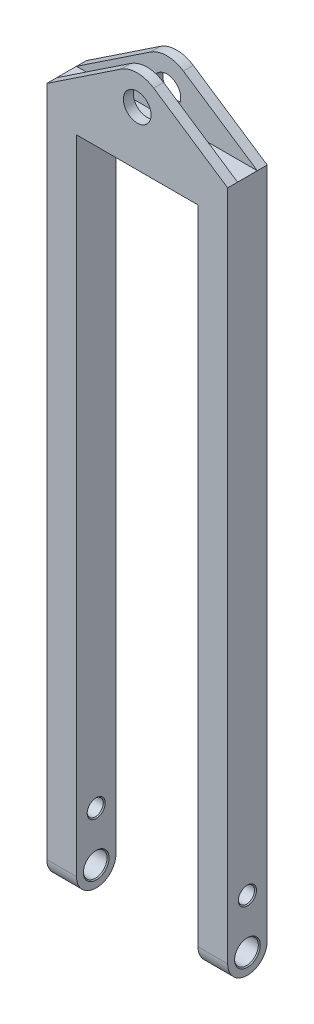
ISO-10303-21;
HEADER;
FILE_DESCRIPTION(('STEP AP214'),'2;1');
FILE_NAME('part.step','',(''),(''),'','','');
FILE_SCHEMA(('AUTOMOTIVE_DESIGN { 1 0 10303 214 1 1 1 1 }'));
ENDSEC;
DATA;
#1=APPLICATION_CONTEXT('core data for automotive mechanical design processes');
#2=APPLICATION_PROTOCOL_DEFINITION('international standard','automotive_design',2000,#1);
#3=PRODUCT_CONTEXT('',#1,'mechanical');
#4=PRODUCT('Part','Part','',(#3));
#5=PRODUCT_RELATED_PRODUCT_CATEGORY('part','',(#4));
#6=PRODUCT_DEFINITION_FORMATION('','',#4);
#7=PRODUCT_DEFINITION_CONTEXT('part definition',#1,'design');
#8=PRODUCT_DEFINITION('design','',#6,#7);
#9=PRODUCT_DEFINITION_SHAPE('','',#8);
#10=(LENGTH_UNIT() NAMED_UNIT(*) SI_UNIT(.MILLI.,.METRE.));
#11=(NAMED_UNIT(*) PLANE_ANGLE_UNIT() SI_UNIT($,.RADIAN.));
#12=(NAMED_UNIT(*) SI_UNIT($,.STERADIAN.) SOLID_ANGLE_UNIT());
#13=UNCERTAINTY_MEASURE_WITH_UNIT(LENGTH_MEASURE(1.E-05),#10,'distance_accuracy_value','');
#14=(GEOMETRIC_REPRESENTATION_CONTEXT(3) GLOBAL_UNCERTAINTY_ASSIGNED_CONTEXT((#13)) GLOBAL_UNIT_ASSIGNED_CONTEXT((#10,
#11,#12)) REPRESENTATION_CONTEXT('',''));
#15=CARTESIAN_POINT('',(0.,0.,0.));
#16=DIRECTION('',(0.,0.,1.));
#17=DIRECTION('',(1.,0.,0.));
#18=AXIS2_PLACEMENT_3D('',#15,#16,#17);
#19=CARTESIAN_POINT('',(183.,700.,40.));
#20=DIRECTION('',(0.555127180319756,0.831765479970308,0.));
#21=DIRECTION('',(-0.831765479970308,0.555127180319756,0.));
#22=AXIS2_PLACEMENT_3D('',#19,#20,#21);
#23=PLANE('',#22);
#24=DIRECTION('',(0.831765479970308,-0.555127180319756,0.));
#25=VECTOR('',#24,1.);
#26=CARTESIAN_POINT('',(183.,700.,30.));
#27=LINE('',#26,#25);
#28=CARTESIAN_POINT('',(108.153815409593,749.952964399109,30.));
#29=VERTEX_POINT('',#28);
#30=CARTESIAN_POINT('',(183.,700.,30.));
#31=VERTEX_POINT('',#30);
#32=EDGE_CURVE('E169',#29,#31,#27,.T.);
#33=ORIENTED_EDGE('',*,*,#32,.F.);
#34=DIRECTION('',(0.,0.,-1.));
#35=VECTOR('',#34,1.);
#36=CARTESIAN_POINT('',(108.153815409593,749.952964399109,40.));
#37=LINE('',#36,#35);
#38=CARTESIAN_POINT('',(108.153815409593,749.952964399109,40.));
#39=VERTEX_POINT('',#38);
#40=EDGE_CURVE('E264',#39,#29,#37,.T.);
#41=ORIENTED_EDGE('',*,*,#40,.F.);
#42=DIRECTION('',(0.831765479970308,-0.555127180319756,0.));
#43=VECTOR('',#42,1.);
#44=CARTESIAN_POINT('',(183.,700.,40.));
#45=LINE('',#44,#43);
#46=CARTESIAN_POINT('',(183.,700.,40.));
#47=VERTEX_POINT('',#46);
#48=EDGE_CURVE('E451',#39,#47,#45,.T.);
#49=ORIENTED_EDGE('',*,*,#48,.T.);
#50=DIRECTION('',(0.,0.,-1.));
#51=VECTOR('',#50,1.);
#52=CARTESIAN_POINT('',(183.,700.,40.));
#53=LINE('',#52,#51);
#54=EDGE_CURVE('E200',#47,#31,#53,.T.);
#55=ORIENTED_EDGE('',*,*,#54,.T.);
#56=EDGE_LOOP('',(#33,#41,#49,#55));
#57=FACE_BOUND('',#56,.T.);
#58=ADVANCED_FACE('F46',(#57),#23,.T.);
#59=CARTESIAN_POINT('',(91.5000000000001,725.,40.));
#60=DIRECTION('',(0.,0.,-1.));
#61=DIRECTION('',(-1.,0.,0.));
#62=AXIS2_PLACEMENT_3D('',#59,#60,#61);
#63=CYLINDRICAL_SURFACE('',#62,30.);
#64=CARTESIAN_POINT('',(91.5000000000001,725.,30.));
#65=DIRECTION('',(0.,0.,1.));
#66=DIRECTION('',(1.,0.,0.));
#67=AXIS2_PLACEMENT_3D('',#64,#65,#66);
#68=CIRCLE('',#67,30.);
#69=CARTESIAN_POINT('',(74.8461845904074,749.952964399109,30.));
#70=VERTEX_POINT('',#69);
#71=EDGE_CURVE('E188',#70,#29,#68,.F.);
#72=ORIENTED_EDGE('',*,*,#71,.F.);
#73=DIRECTION('',(0.,0.,-1.));
#74=VECTOR('',#73,1.);
#75=CARTESIAN_POINT('',(74.8461845904074,749.952964399109,40.));
#76=LINE('',#75,#74);
#77=CARTESIAN_POINT('',(74.8461845904074,749.952964399109,40.));
#78=VERTEX_POINT('',#77);
#79=EDGE_CURVE('E186',#78,#70,#76,.T.);
#80=ORIENTED_EDGE('',*,*,#79,.F.);
#81=CARTESIAN_POINT('',(91.5000000000001,725.,40.));
#82=DIRECTION('',(0.,0.,-1.));
#83=DIRECTION('',(1.,0.,0.));
#84=AXIS2_PLACEMENT_3D('',#81,#82,#83);
#85=CIRCLE('',#84,30.);
#86=EDGE_CURVE('E446',#78,#39,#85,.T.);
#87=ORIENTED_EDGE('',*,*,#86,.T.);
#88=ORIENTED_EDGE('',*,*,#40,.T.);
#89=EDGE_LOOP('',(#72,#80,#87,#88));
#90=FACE_BOUND('',#89,.T.);
#91=ADVANCED_FACE('F383',(#90),#63,.T.);
#92=CARTESIAN_POINT('',(74.8461845904074,749.952964399109,40.));
#93=DIRECTION('',(-0.555127180319756,0.831765479970308,0.));
#94=DIRECTION('',(-0.831765479970308,-0.555127180319756,0.));
#95=AXIS2_PLACEMENT_3D('',#92,#93,#94);
#96=PLANE('',#95);
#97=DIRECTION('',(0.831765479970308,0.555127180319756,0.));
#98=VECTOR('',#97,1.);
#99=CARTESIAN_POINT('',(74.8461845904074,749.952964399109,30.));
#100=LINE('',#99,#98);
#101=CARTESIAN_POINT('',(0.,700.,30.));
#102=VERTEX_POINT('',#101);
#103=EDGE_CURVE('E166',#102,#70,#100,.T.);
#104=ORIENTED_EDGE('',*,*,#103,.F.);
#105=DIRECTION('',(0.,0.,-1.));
#106=VECTOR('',#105,1.);
#107=CARTESIAN_POINT('',(0.,700.,40.));
#108=LINE('',#107,#106);
#109=CARTESIAN_POINT('',(0.,700.,40.));
#110=VERTEX_POINT('',#109);
#111=EDGE_CURVE('E184',#110,#102,#108,.T.);
#112=ORIENTED_EDGE('',*,*,#111,.F.);
#113=DIRECTION('',(0.831765479970308,0.555127180319756,0.));
#114=VECTOR('',#113,1.);
#115=CARTESIAN_POINT('',(74.8461845904074,749.952964399109,40.));
#116=LINE('',#115,#114);
#117=EDGE_CURVE('E518',#110,#78,#116,.T.);
#118=ORIENTED_EDGE('',*,*,#117,.T.);
#119=ORIENTED_EDGE('',*,*,#79,.T.);
#120=EDGE_LOOP('',(#104,#112,#118,#119));
#121=FACE_BOUND('',#120,.T.);
#122=ADVANCED_FACE('F182',(#121),#96,.T.);
#123=CARTESIAN_POINT('',(91.5000000000001,725.,40.));
#124=DIRECTION('',(0.,0.,-1.));
#125=DIRECTION('',(-1.,0.,0.));
#126=AXIS2_PLACEMENT_3D('',#123,#124,#125);
#127=CYLINDRICAL_SURFACE('',#126,14.);
#128=CARTESIAN_POINT('',(91.5000000000001,725.,30.));
#129=DIRECTION('',(0.,0.,1.));
#130=DIRECTION('',(1.,0.,0.));
#131=AXIS2_PLACEMENT_3D('',#128,#129,#130);
#132=CIRCLE('',#131,14.);
#133=CARTESIAN_POINT('',(105.5,725.,30.));
#134=VERTEX_POINT('',#133);
#135=EDGE_CURVE('E189',#134,#134,#132,.F.);
#136=ORIENTED_EDGE('',*,*,#135,.T.);
#137=EDGE_LOOP('',(#136));
#138=FACE_BOUND('',#137,.T.);
#139=CARTESIAN_POINT('',(91.5000000000001,725.,40.));
#140=DIRECTION('',(0.,0.,-1.));
#141=DIRECTION('',(-1.,0.,0.));
#142=AXIS2_PLACEMENT_3D('',#139,#140,#141);
#143=CIRCLE('',#142,14.);
#144=CARTESIAN_POINT('',(77.5000000000001,725.,40.));
#145=VERTEX_POINT('',#144);
#146=EDGE_CURVE('E437',#145,#145,#143,.T.);
#147=ORIENTED_EDGE('',*,*,#146,.F.);
#148=EDGE_LOOP('',(#147));
#149=FACE_BOUND('',#148,.T.);
#150=ADVANCED_FACE('F617',(#138,#149),#127,.F.);
#151=CARTESIAN_POINT('',(0.,0.,40.));
#152=DIRECTION('',(1.,0.,0.));
#153=DIRECTION('',(0.,0.,-1.));
#154=AXIS2_PLACEMENT_3D('',#151,#152,#153);
#155=PLANE('',#154);
#156=CARTESIAN_POINT('',(0.,20.,20.));
#157=DIRECTION('',(1.,0.,0.));
#158=DIRECTION('',(0.,0.,-1.));
#159=AXIS2_PLACEMENT_3D('',#156,#157,#158);
#160=CIRCLE('',#159,13.0000000000001);
#161=CARTESIAN_POINT('',(0.,20.,6.99999999999988));
#162=VERTEX_POINT('',#161);
#163=EDGE_CURVE('E11',#162,#162,#160,.T.);
#164=ORIENTED_EDGE('',*,*,#163,.T.);
#165=EDGE_LOOP('',(#164));
#166=FACE_BOUND('',#165,.T.);
#167=CARTESIAN_POINT('',(0.,70.,20.));
#168=DIRECTION('',(1.,0.,0.));
#169=DIRECTION('',(0.,0.,-1.));
#170=AXIS2_PLACEMENT_3D('',#167,#168,#169);
#171=CIRCLE('',#170,9.1500000000001);
#172=CARTESIAN_POINT('',(0.,70.,10.8499999999999));
#173=VERTEX_POINT('',#172);
#174=EDGE_CURVE('E56',#173,#173,#171,.T.);
#175=ORIENTED_EDGE('',*,*,#174,.T.);
#176=EDGE_LOOP('',(#175));
#177=FACE_BOUND('',#176,.T.);
#178=DIRECTION('',(0.,-1.,0.));
#179=VECTOR('',#178,1.);
#180=CARTESIAN_POINT('',(0.,0.,0.));
#181=LINE('',#180,#179);
#182=CARTESIAN_POINT('',(0.,700.,0.));
#183=VERTEX_POINT('',#182);
#184=CARTESIAN_POINT('',(0.,20.,0.));
#185=VERTEX_POINT('',#184);
#186=EDGE_CURVE('E259',#183,#185,#181,.T.);
#187=ORIENTED_EDGE('',*,*,#186,.T.);
#188=CARTESIAN_POINT('',(0.,20.,20.));
#189=DIRECTION('',(1.,0.,0.));
#190=DIRECTION('',(0.,0.,-1.));
#191=AXIS2_PLACEMENT_3D('',#188,#189,#190);
#192=CIRCLE('',#191,20.);
#193=CARTESIAN_POINT('',(0.,0.,20.));
#194=VERTEX_POINT('',#193);
#195=EDGE_CURVE('E71',#185,#194,#192,.F.);
#196=ORIENTED_EDGE('',*,*,#195,.T.);
#197=CARTESIAN_POINT('',(0.,20.,20.));
#198=DIRECTION('',(1.,0.,0.));
#199=DIRECTION('',(0.,0.,-1.));
#200=AXIS2_PLACEMENT_3D('',#197,#198,#199);
#201=CIRCLE('',#200,20.);
#202=CARTESIAN_POINT('',(0.,20.,40.));
#203=VERTEX_POINT('',#202);
#204=EDGE_CURVE('E249',#194,#203,#201,.F.);
#205=ORIENTED_EDGE('',*,*,#204,.T.);
#206=DIRECTION('',(0.,-1.,0.));
#207=VECTOR('',#206,1.);
#208=CARTESIAN_POINT('',(0.,0.,40.));
#209=LINE('',#208,#207);
#210=EDGE_CURVE('E193',#110,#203,#209,.T.);
#211=ORIENTED_EDGE('',*,*,#210,.F.);
#212=ORIENTED_EDGE('',*,*,#111,.T.);
#213=DIRECTION('',(0.,0.,-1.));
#214=VECTOR('',#213,1.);
#215=CARTESIAN_POINT('',(0.,700.,30.));
#216=LINE('',#215,#214);
#217=CARTESIAN_POINT('',(0.,700.,10.));
#218=VERTEX_POINT('',#217);
#219=EDGE_CURVE('E172',#102,#218,#216,.T.);
#220=ORIENTED_EDGE('',*,*,#219,.T.);
#221=EDGE_CURVE('E196',#218,#183,#108,.T.);
#222=ORIENTED_EDGE('',*,*,#221,.T.);
#223=EDGE_LOOP('',(#187,#196,#205,#211,#212,#220,#222));
#224=FACE_BOUND('',#223,.T.);
#225=ADVANCED_FACE('F191',(#166,#177,#224),#155,.F.);
#226=CARTESIAN_POINT('',(30.,0.,40.));
#227=DIRECTION('',(-1.,0.,0.));
#228=DIRECTION('',(0.,0.,1.));
#229=AXIS2_PLACEMENT_3D('',#226,#227,#228);
#230=PLANE('',#229);
#231=CARTESIAN_POINT('',(30.,20.,20.));
#232=DIRECTION('',(-1.,0.,0.));
#233=DIRECTION('',(0.,0.,1.));
#234=AXIS2_PLACEMENT_3D('',#231,#232,#233);
#235=CIRCLE('',#234,12.9999999999999);
#236=CARTESIAN_POINT('',(30.,20.,32.9999999999999));
#237=VERTEX_POINT('',#236);
#238=EDGE_CURVE('E349',#237,#237,#235,.T.);
#239=ORIENTED_EDGE('',*,*,#238,.T.);
#240=EDGE_LOOP('',(#239));
#241=FACE_BOUND('',#240,.T.);
#242=CARTESIAN_POINT('',(30.,70.,20.));
#243=DIRECTION('',(-1.,0.,0.));
#244=DIRECTION('',(0.,0.,1.));
#245=AXIS2_PLACEMENT_3D('',#242,#243,#244);
#246=CIRCLE('',#245,9.14999999999999);
#247=CARTESIAN_POINT('',(30.,70.,29.15));
#248=VERTEX_POINT('',#247);
#249=EDGE_CURVE('E345',#248,#248,#246,.T.);
#250=ORIENTED_EDGE('',*,*,#249,.T.);
#251=EDGE_LOOP('',(#250));
#252=FACE_BOUND('',#251,.T.);
#253=CARTESIAN_POINT('',(30.,20.,20.));
#254=DIRECTION('',(-1.,0.,0.));
#255=DIRECTION('',(0.,0.,1.));
#256=AXIS2_PLACEMENT_3D('',#253,#254,#255);
#257=CIRCLE('',#256,20.);
#258=CARTESIAN_POINT('',(30.,20.,40.));
#259=VERTEX_POINT('',#258);
#260=CARTESIAN_POINT('',(30.,0.,20.));
#261=VERTEX_POINT('',#260);
#262=EDGE_CURVE('E243',#259,#261,#257,.F.);
#263=ORIENTED_EDGE('',*,*,#262,.T.);
#264=CARTESIAN_POINT('',(30.,20.,20.));
#265=DIRECTION('',(-1.,0.,0.));
#266=DIRECTION('',(0.,0.,1.));
#267=AXIS2_PLACEMENT_3D('',#264,#265,#266);
#268=CIRCLE('',#267,20.);
#269=CARTESIAN_POINT('',(30.,20.,0.));
#270=VERTEX_POINT('',#269);
#271=EDGE_CURVE('E246',#261,#270,#268,.F.);
#272=ORIENTED_EDGE('',*,*,#271,.T.);
#273=DIRECTION('',(0.,1.,0.));
#274=VECTOR('',#273,1.);
#275=CARTESIAN_POINT('',(30.,0.,0.));
#276=LINE('',#275,#274);
#277=CARTESIAN_POINT('',(30.,670.,0.));
#278=VERTEX_POINT('',#277);
#279=EDGE_CURVE('E474',#270,#278,#276,.T.);
#280=ORIENTED_EDGE('',*,*,#279,.T.);
#281=DIRECTION('',(0.,0.,-1.));
#282=VECTOR('',#281,1.);
#283=CARTESIAN_POINT('',(30.,670.,40.));
#284=LINE('',#283,#282);
#285=CARTESIAN_POINT('',(30.,670.,40.));
#286=VERTEX_POINT('',#285);
#287=EDGE_CURVE('E213',#286,#278,#284,.T.);
#288=ORIENTED_EDGE('',*,*,#287,.F.);
#289=DIRECTION('',(0.,1.,0.));
#290=VECTOR('',#289,1.);
#291=CARTESIAN_POINT('',(30.,0.,40.));
#292=LINE('',#291,#290);
#293=EDGE_CURVE('E460',#259,#286,#292,.T.);
#294=ORIENTED_EDGE('',*,*,#293,.F.);
#295=EDGE_LOOP('',(#263,#272,#280,#288,#294));
#296=FACE_BOUND('',#295,.T.);
#297=ADVANCED_FACE('F506',(#241,#252,#296),#230,.F.);
#298=CARTESIAN_POINT('',(30.,670.,40.));
#299=DIRECTION('',(0.,1.,0.));
#300=DIRECTION('',(0.,0.,1.));
#301=AXIS2_PLACEMENT_3D('',#298,#299,#300);
#302=PLANE('',#301);
#303=DIRECTION('',(1.,0.,0.));
#304=VECTOR('',#303,1.);
#305=CARTESIAN_POINT('',(30.,670.,0.));
#306=LINE('',#305,#304);
#307=CARTESIAN_POINT('',(153.,670.,0.));
#308=VERTEX_POINT('',#307);
#309=EDGE_CURVE('E477',#278,#308,#306,.T.);
#310=ORIENTED_EDGE('',*,*,#309,.T.);
#311=DIRECTION('',(0.,0.,-1.));
#312=VECTOR('',#311,1.);
#313=CARTESIAN_POINT('',(153.,670.,40.));
#314=LINE('',#313,#312);
#315=CARTESIAN_POINT('',(153.,670.,40.));
#316=VERTEX_POINT('',#315);
#317=EDGE_CURVE('E209',#316,#308,#314,.T.);
#318=ORIENTED_EDGE('',*,*,#317,.F.);
#319=DIRECTION('',(1.,0.,0.));
#320=VECTOR('',#319,1.);
#321=CARTESIAN_POINT('',(30.,670.,40.));
#322=LINE('',#321,#320);
#323=EDGE_CURVE('E463',#286,#316,#322,.T.);
#324=ORIENTED_EDGE('',*,*,#323,.F.);
#325=ORIENTED_EDGE('',*,*,#287,.T.);
#326=EDGE_LOOP('',(#310,#318,#324,#325));
#327=FACE_BOUND('',#326,.T.);
#328=ADVANCED_FACE('F504',(#327),#302,.F.);
#329=CARTESIAN_POINT('',(153.,670.,40.));
#330=DIRECTION('',(1.,0.,0.));
#331=DIRECTION('',(0.,1.,0.));
#332=AXIS2_PLACEMENT_3D('',#329,#330,#331);
#333=PLANE('',#332);
#334=CARTESIAN_POINT('',(153.,70.,20.));
#335=DIRECTION('',(1.,0.,0.));
#336=DIRECTION('',(0.,1.,0.));
#337=AXIS2_PLACEMENT_3D('',#334,#335,#336);
#338=CIRCLE('',#337,9.15000000000001);
#339=CARTESIAN_POINT('',(153.,79.15,20.));
#340=VERTEX_POINT('',#339);
#341=EDGE_CURVE('E333',#340,#340,#338,.T.);
#342=ORIENTED_EDGE('',*,*,#341,.T.);
#343=EDGE_LOOP('',(#342));
#344=FACE_BOUND('',#343,.T.);
#345=CARTESIAN_POINT('',(153.,20.,20.));
#346=DIRECTION('',(1.,0.,0.));
#347=DIRECTION('',(0.,1.,0.));
#348=AXIS2_PLACEMENT_3D('',#345,#346,#347);
#349=CIRCLE('',#348,12.9999999999998);
#350=CARTESIAN_POINT('',(153.,32.9999999999998,20.));
#351=VERTEX_POINT('',#350);
#352=EDGE_CURVE('E329',#351,#351,#349,.T.);
#353=ORIENTED_EDGE('',*,*,#352,.T.);
#354=EDGE_LOOP('',(#353));
#355=FACE_BOUND('',#354,.T.);
#356=CARTESIAN_POINT('',(153.,417.5,20.));
#357=DIRECTION('',(1.,0.,0.));
#358=DIRECTION('',(0.,1.,0.));
#359=AXIS2_PLACEMENT_3D('',#356,#357,#358);
#360=CIRCLE('',#359,2.1500000000001);
#361=CARTESIAN_POINT('',(153.,419.65,20.));
#362=VERTEX_POINT('',#361);
#363=EDGE_CURVE('E293',#362,#362,#360,.T.);
#364=ORIENTED_EDGE('',*,*,#363,.T.);
#365=EDGE_LOOP('',(#364));
#366=FACE_BOUND('',#365,.T.);
#367=CARTESIAN_POINT('',(153.,477.5,20.));
#368=DIRECTION('',(1.,0.,0.));
#369=DIRECTION('',(0.,1.,0.));
#370=AXIS2_PLACEMENT_3D('',#367,#368,#369);
#371=CIRCLE('',#370,2.1500000000001);
#372=CARTESIAN_POINT('',(153.,479.65,20.));
#373=VERTEX_POINT('',#372);
#374=EDGE_CURVE('E289',#373,#373,#371,.T.);
#375=ORIENTED_EDGE('',*,*,#374,.T.);
#376=EDGE_LOOP('',(#375));
#377=FACE_BOUND('',#376,.T.);
#378=CARTESIAN_POINT('',(153.,537.5,20.));
#379=DIRECTION('',(1.,0.,0.));
#380=DIRECTION('',(0.,1.,0.));
#381=AXIS2_PLACEMENT_3D('',#378,#379,#380);
#382=CIRCLE('',#381,2.1500000000001);
#383=CARTESIAN_POINT('',(153.,539.65,20.));
#384=VERTEX_POINT('',#383);
#385=EDGE_CURVE('E285',#384,#384,#382,.T.);
#386=ORIENTED_EDGE('',*,*,#385,.T.);
#387=EDGE_LOOP('',(#386));
#388=FACE_BOUND('',#387,.T.);
#389=CARTESIAN_POINT('',(153.,597.5,20.));
#390=DIRECTION('',(1.,0.,0.));
#391=DIRECTION('',(0.,1.,0.));
#392=AXIS2_PLACEMENT_3D('',#389,#390,#391);
#393=CIRCLE('',#392,2.1500000000001);
#394=CARTESIAN_POINT('',(153.,599.65,20.));
#395=VERTEX_POINT('',#394);
#396=EDGE_CURVE('E281',#395,#395,#393,.T.);
#397=ORIENTED_EDGE('',*,*,#396,.T.);
#398=EDGE_LOOP('',(#397));
#399=FACE_BOUND('',#398,.T.);
#400=CARTESIAN_POINT('',(153.,657.5,20.));
#401=DIRECTION('',(1.,0.,0.));
#402=DIRECTION('',(0.,1.,0.));
#403=AXIS2_PLACEMENT_3D('',#400,#401,#402);
#404=CIRCLE('',#403,2.1500000000001);
#405=CARTESIAN_POINT('',(153.,659.65,20.));
#406=VERTEX_POINT('',#405);
#407=EDGE_CURVE('E277',#406,#406,#404,.T.);
#408=ORIENTED_EDGE('',*,*,#407,.T.);
#409=EDGE_LOOP('',(#408));
#410=FACE_BOUND('',#409,.T.);
#411=DIRECTION('',(0.,-1.,0.));
#412=VECTOR('',#411,1.);
#413=CARTESIAN_POINT('',(153.,670.,0.));
#414=LINE('',#413,#412);
#415=CARTESIAN_POINT('',(153.,20.,0.));
#416=VERTEX_POINT('',#415);
#417=EDGE_CURVE('E427',#308,#416,#414,.T.);
#418=ORIENTED_EDGE('',*,*,#417,.T.);
#419=CARTESIAN_POINT('',(153.,20.,20.));
#420=DIRECTION('',(1.,0.,0.));
#421=DIRECTION('',(0.,1.,0.));
#422=AXIS2_PLACEMENT_3D('',#419,#420,#421);
#423=CIRCLE('',#422,20.);
#424=CARTESIAN_POINT('',(153.,0.,20.));
#425=VERTEX_POINT('',#424);
#426=EDGE_CURVE('E234',#416,#425,#423,.F.);
#427=ORIENTED_EDGE('',*,*,#426,.T.);
#428=CARTESIAN_POINT('',(153.,20.,20.));
#429=DIRECTION('',(1.,0.,0.));
#430=DIRECTION('',(0.,1.,0.));
#431=AXIS2_PLACEMENT_3D('',#428,#429,#430);
#432=CIRCLE('',#431,20.);
#433=CARTESIAN_POINT('',(153.,20.,40.));
#434=VERTEX_POINT('',#433);
#435=EDGE_CURVE('E231',#425,#434,#432,.F.);
#436=ORIENTED_EDGE('',*,*,#435,.T.);
#437=DIRECTION('',(0.,-1.,0.));
#438=VECTOR('',#437,1.);
#439=CARTESIAN_POINT('',(153.,670.,40.));
#440=LINE('',#439,#438);
#441=EDGE_CURVE('E466',#316,#434,#440,.T.);
#442=ORIENTED_EDGE('',*,*,#441,.F.);
#443=ORIENTED_EDGE('',*,*,#317,.T.);
#444=EDGE_LOOP('',(#418,#427,#436,#442,#443));
#445=FACE_BOUND('',#444,.T.);
#446=ADVANCED_FACE('F483',(#344,#355,#366,#377,#388,#399,#410,#445),#333,.F.);
#447=CARTESIAN_POINT('',(183.,700.,40.));
#448=DIRECTION('',(-1.,0.,0.));
#449=DIRECTION('',(0.,-1.,0.));
#450=AXIS2_PLACEMENT_3D('',#447,#448,#449);
#451=PLANE('',#450);
#452=CARTESIAN_POINT('',(183.,70.,20.));
#453=DIRECTION('',(-1.,0.,0.));
#454=DIRECTION('',(0.,-1.,0.));
#455=AXIS2_PLACEMENT_3D('',#452,#453,#454);
#456=CIRCLE('',#455,9.14999999999999);
#457=CARTESIAN_POINT('',(183.,60.85,20.));
#458=VERTEX_POINT('',#457);
#459=EDGE_CURVE('E325',#458,#458,#456,.T.);
#460=ORIENTED_EDGE('',*,*,#459,.T.);
#461=EDGE_LOOP('',(#460));
#462=FACE_BOUND('',#461,.T.);
#463=CARTESIAN_POINT('',(183.,20.,20.));
#464=DIRECTION('',(-1.,0.,0.));
#465=DIRECTION('',(0.,-1.,0.));
#466=AXIS2_PLACEMENT_3D('',#463,#464,#465);
#467=CIRCLE('',#466,13.0000000000001);
#468=CARTESIAN_POINT('',(183.,6.99999999999989,20.));
#469=VERTEX_POINT('',#468);
#470=EDGE_CURVE('E321',#469,#469,#467,.T.);
#471=ORIENTED_EDGE('',*,*,#470,.T.);
#472=EDGE_LOOP('',(#471));
#473=FACE_BOUND('',#472,.T.);
#474=CARTESIAN_POINT('',(183.,20.,20.));
#475=DIRECTION('',(-1.,0.,0.));
#476=DIRECTION('',(0.,-1.,0.));
#477=AXIS2_PLACEMENT_3D('',#474,#475,#476);
#478=CIRCLE('',#477,20.);
#479=CARTESIAN_POINT('',(183.,20.,40.));
#480=VERTEX_POINT('',#479);
#481=CARTESIAN_POINT('',(183.,0.,20.));
#482=VERTEX_POINT('',#481);
#483=EDGE_CURVE('E217',#480,#482,#478,.F.);
#484=ORIENTED_EDGE('',*,*,#483,.T.);
#485=CARTESIAN_POINT('',(183.,20.,20.));
#486=DIRECTION('',(-1.,0.,0.));
#487=DIRECTION('',(0.,-1.,0.));
#488=AXIS2_PLACEMENT_3D('',#485,#486,#487);
#489=CIRCLE('',#488,20.);
#490=CARTESIAN_POINT('',(183.,20.,0.));
#491=VERTEX_POINT('',#490);
#492=EDGE_CURVE('E220',#482,#491,#489,.F.);
#493=ORIENTED_EDGE('',*,*,#492,.T.);
#494=DIRECTION('',(0.,1.,0.));
#495=VECTOR('',#494,1.);
#496=CARTESIAN_POINT('',(183.,700.,0.));
#497=LINE('',#496,#495);
#498=CARTESIAN_POINT('',(183.,700.,0.));
#499=VERTEX_POINT('',#498);
#500=EDGE_CURVE('E204',#491,#499,#497,.T.);
#501=ORIENTED_EDGE('',*,*,#500,.T.);
#502=CARTESIAN_POINT('',(183.,700.,10.));
#503=VERTEX_POINT('',#502);
#504=EDGE_CURVE('E195',#503,#499,#53,.T.);
#505=ORIENTED_EDGE('',*,*,#504,.F.);
#506=DIRECTION('',(0.,0.,-1.));
#507=VECTOR('',#506,1.);
#508=CARTESIAN_POINT('',(183.,700.,30.));
#509=LINE('',#508,#507);
#510=EDGE_CURVE('E178',#31,#503,#509,.T.);
#511=ORIENTED_EDGE('',*,*,#510,.F.);
#512=ORIENTED_EDGE('',*,*,#54,.F.);
#513=DIRECTION('',(0.,1.,0.));
#514=VECTOR('',#513,1.);
#515=CARTESIAN_POINT('',(183.,700.,40.));
#516=LINE('',#515,#514);
#517=EDGE_CURVE('E202',#480,#47,#516,.T.);
#518=ORIENTED_EDGE('',*,*,#517,.F.);
#519=EDGE_LOOP('',(#484,#493,#501,#505,#511,#512,#518));
#520=FACE_BOUND('',#519,.T.);
#521=ADVANCED_FACE('F419',(#462,#473,#520),#451,.F.);
#522=CARTESIAN_POINT('',(0.,0.,40.));
#523=DIRECTION('',(0.,0.,-1.));
#524=DIRECTION('',(-1.,0.,0.));
#525=AXIS2_PLACEMENT_3D('',#522,#523,#524);
#526=PLANE('',#525);
#527=ORIENTED_EDGE('',*,*,#441,.T.);
#528=DIRECTION('',(1.,0.,0.));
#529=VECTOR('',#528,1.);
#530=CARTESIAN_POINT('',(0.,20.,40.));
#531=LINE('',#530,#529);
#532=EDGE_CURVE('E240',#434,#480,#531,.T.);
#533=ORIENTED_EDGE('',*,*,#532,.T.);
#534=ORIENTED_EDGE('',*,*,#517,.T.);
#535=ORIENTED_EDGE('',*,*,#48,.F.);
#536=ORIENTED_EDGE('',*,*,#86,.F.);
#537=ORIENTED_EDGE('',*,*,#117,.F.);
#538=ORIENTED_EDGE('',*,*,#210,.T.);
#539=DIRECTION('',(1.,0.,0.));
#540=VECTOR('',#539,1.);
#541=CARTESIAN_POINT('',(0.,20.,40.));
#542=LINE('',#541,#540);
#543=EDGE_CURVE('E237',#203,#259,#542,.T.);
#544=ORIENTED_EDGE('',*,*,#543,.T.);
#545=ORIENTED_EDGE('',*,*,#293,.T.);
#546=ORIENTED_EDGE('',*,*,#323,.T.);
#547=EDGE_LOOP('',(#527,#533,#534,#535,#536,#537,#538,#544,#545,#546));
#548=FACE_BOUND('',#547,.T.);
#549=ORIENTED_EDGE('',*,*,#146,.T.);
#550=EDGE_LOOP('',(#549));
#551=FACE_BOUND('',#550,.T.);
#552=ADVANCED_FACE('F497',(#548,#551),#526,.F.);
#553=CARTESIAN_POINT('',(0.,0.,0.));
#554=DIRECTION('',(0.,0.,-1.));
#555=DIRECTION('',(-1.,0.,0.));
#556=AXIS2_PLACEMENT_3D('',#553,#554,#555);
#557=PLANE('',#556);
#558=ORIENTED_EDGE('',*,*,#500,.F.);
#559=DIRECTION('',(1.,0.,0.));
#560=VECTOR('',#559,1.);
#561=CARTESIAN_POINT('',(153.,20.,0.));
#562=LINE('',#561,#560);
#563=EDGE_CURVE('E227',#491,#416,#562,.F.);
#564=ORIENTED_EDGE('',*,*,#563,.T.);
#565=ORIENTED_EDGE('',*,*,#417,.F.);
#566=ORIENTED_EDGE('',*,*,#309,.F.);
#567=ORIENTED_EDGE('',*,*,#279,.F.);
#568=DIRECTION('',(1.,0.,0.));
#569=VECTOR('',#568,1.);
#570=CARTESIAN_POINT('',(0.,20.,0.));
#571=LINE('',#570,#569);
#572=EDGE_CURVE('E223',#270,#185,#571,.F.);
#573=ORIENTED_EDGE('',*,*,#572,.T.);
#574=ORIENTED_EDGE('',*,*,#186,.F.);
#575=DIRECTION('',(0.831765479970308,0.555127180319756,0.));
#576=VECTOR('',#575,1.);
#577=CARTESIAN_POINT('',(74.8461845904074,749.952964399109,0.));
#578=LINE('',#577,#576);
#579=CARTESIAN_POINT('',(74.8461845904074,749.952964399109,0.));
#580=VERTEX_POINT('',#579);
#581=EDGE_CURVE('E436',#183,#580,#578,.T.);
#582=ORIENTED_EDGE('',*,*,#581,.T.);
#583=CARTESIAN_POINT('',(91.5000000000001,725.,0.));
#584=DIRECTION('',(0.,0.,-1.));
#585=DIRECTION('',(1.,0.,0.));
#586=AXIS2_PLACEMENT_3D('',#583,#584,#585);
#587=CIRCLE('',#586,30.);
#588=CARTESIAN_POINT('',(108.153815409593,749.952964399109,0.));
#589=VERTEX_POINT('',#588);
#590=EDGE_CURVE('E434',#580,#589,#587,.T.);
#591=ORIENTED_EDGE('',*,*,#590,.T.);
#592=DIRECTION('',(0.831765479970308,-0.555127180319756,0.));
#593=VECTOR('',#592,1.);
#594=CARTESIAN_POINT('',(183.,700.,0.));
#595=LINE('',#594,#593);
#596=EDGE_CURVE('E429',#589,#499,#595,.T.);
#597=ORIENTED_EDGE('',*,*,#596,.T.);
#598=EDGE_LOOP('',(#558,#564,#565,#566,#567,#573,#574,#582,#591,#597));
#599=FACE_BOUND('',#598,.T.);
#600=CARTESIAN_POINT('',(91.5000000000001,725.,0.));
#601=DIRECTION('',(0.,0.,-1.));
#602=DIRECTION('',(-1.,0.,0.));
#603=AXIS2_PLACEMENT_3D('',#600,#601,#602);
#604=CIRCLE('',#603,14.);
#605=CARTESIAN_POINT('',(77.5000000000001,725.,0.));
#606=VERTEX_POINT('',#605);
#607=EDGE_CURVE('E443',#606,#606,#604,.T.);
#608=ORIENTED_EDGE('',*,*,#607,.F.);
#609=EDGE_LOOP('',(#608));
#610=FACE_BOUND('',#609,.T.);
#611=ADVANCED_FACE('F430',(#599,#610),#557,.T.);
#612=CARTESIAN_POINT('',(0.,20.,20.));
#613=DIRECTION('',(1.,0.,0.));
#614=DIRECTION('',(0.,1.,0.));
#615=AXIS2_PLACEMENT_3D('',#612,#613,#614);
#616=CYLINDRICAL_SURFACE('',#615,20.);
#617=ORIENTED_EDGE('',*,*,#532,.F.);
#618=ORIENTED_EDGE('',*,*,#435,.F.);
#619=DIRECTION('',(1.,0.,0.));
#620=VECTOR('',#619,1.);
#621=CARTESIAN_POINT('',(153.,0.,20.));
#622=LINE('',#621,#620);
#623=EDGE_CURVE('E255',#482,#425,#622,.F.);
#624=ORIENTED_EDGE('',*,*,#623,.F.);
#625=ORIENTED_EDGE('',*,*,#483,.F.);
#626=EDGE_LOOP('',(#617,#618,#624,#625));
#627=FACE_BOUND('',#626,.T.);
#628=ADVANCED_FACE('F495',(#627),#616,.T.);
#629=CARTESIAN_POINT('',(153.,20.,20.));
#630=DIRECTION('',(-1.,0.,0.));
#631=DIRECTION('',(0.,-1.,0.));
#632=AXIS2_PLACEMENT_3D('',#629,#630,#631);
#633=CYLINDRICAL_SURFACE('',#632,20.);
#634=ORIENTED_EDGE('',*,*,#426,.F.);
#635=ORIENTED_EDGE('',*,*,#563,.F.);
#636=ORIENTED_EDGE('',*,*,#492,.F.);
#637=ORIENTED_EDGE('',*,*,#623,.T.);
#638=EDGE_LOOP('',(#634,#635,#636,#637));
#639=FACE_BOUND('',#638,.T.);
#640=ADVANCED_FACE('F490',(#639),#633,.T.);
#641=CARTESIAN_POINT('',(0.,20.,20.));
#642=DIRECTION('',(1.,0.,0.));
#643=DIRECTION('',(0.,0.,-1.));
#644=AXIS2_PLACEMENT_3D('',#641,#642,#643);
#645=CYLINDRICAL_SURFACE('',#644,20.);
#646=ORIENTED_EDGE('',*,*,#543,.F.);
#647=ORIENTED_EDGE('',*,*,#204,.F.);
#648=DIRECTION('',(1.,0.,0.));
#649=VECTOR('',#648,1.);
#650=CARTESIAN_POINT('',(0.,0.,20.));
#651=LINE('',#650,#649);
#652=EDGE_CURVE('E260',#261,#194,#651,.F.);
#653=ORIENTED_EDGE('',*,*,#652,.F.);
#654=ORIENTED_EDGE('',*,*,#262,.F.);
#655=EDGE_LOOP('',(#646,#647,#653,#654));
#656=FACE_BOUND('',#655,.T.);
#657=ADVANCED_FACE('F516',(#656),#645,.T.);
#658=CARTESIAN_POINT('',(0.,20.,20.));
#659=DIRECTION('',(-1.,0.,0.));
#660=DIRECTION('',(0.,0.,1.));
#661=AXIS2_PLACEMENT_3D('',#658,#659,#660);
#662=CYLINDRICAL_SURFACE('',#661,20.);
#663=ORIENTED_EDGE('',*,*,#195,.F.);
#664=ORIENTED_EDGE('',*,*,#572,.F.);
#665=ORIENTED_EDGE('',*,*,#271,.F.);
#666=ORIENTED_EDGE('',*,*,#652,.T.);
#667=EDGE_LOOP('',(#663,#664,#665,#666));
#668=FACE_BOUND('',#667,.T.);
#669=ADVANCED_FACE('F512',(#668),#662,.T.);
#670=CARTESIAN_POINT('',(183.,20.,20.));
#671=DIRECTION('',(-1.,0.,0.));
#672=DIRECTION('',(0.,0.,1.));
#673=AXIS2_PLACEMENT_3D('',#670,#671,#672);
#674=CYLINDRICAL_SURFACE('',#673,12.);
#675=CARTESIAN_POINT('',(182.,20.,20.));
#676=DIRECTION('',(-1.,0.,0.));
#677=DIRECTION('',(0.,0.,1.));
#678=AXIS2_PLACEMENT_3D('',#675,#676,#677);
#679=CIRCLE('',#678,12.);
#680=CARTESIAN_POINT('',(182.,20.,32.));
#681=VERTEX_POINT('',#680);
#682=EDGE_CURVE('E341',#681,#681,#679,.F.);
#683=ORIENTED_EDGE('',*,*,#682,.T.);
#684=EDGE_LOOP('',(#683));
#685=FACE_BOUND('',#684,.T.);
#686=CARTESIAN_POINT('',(154.,20.,20.));
#687=DIRECTION('',(1.,0.,0.));
#688=DIRECTION('',(0.,0.,-1.));
#689=AXIS2_PLACEMENT_3D('',#686,#687,#688);
#690=CIRCLE('',#689,12.);
#691=CARTESIAN_POINT('',(154.,20.,8.));
#692=VERTEX_POINT('',#691);
#693=EDGE_CURVE('E337',#692,#692,#690,.F.);
#694=ORIENTED_EDGE('',*,*,#693,.T.);
#695=EDGE_LOOP('',(#694));
#696=FACE_BOUND('',#695,.T.);
#697=ADVANCED_FACE('F664',(#685,#696),#674,.F.);
#698=CARTESIAN_POINT('',(29.0000000000001,20.,20.));
#699=DIRECTION('',(-1.,0.,0.));
#700=DIRECTION('',(0.,0.,1.));
#701=AXIS2_PLACEMENT_3D('',#698,#699,#700);
#702=CIRCLE('',#701,12.);
#703=CARTESIAN_POINT('',(29.0000000000001,20.,32.));
#704=VERTEX_POINT('',#703);
#705=EDGE_CURVE('E357',#704,#704,#702,.F.);
#706=ORIENTED_EDGE('',*,*,#705,.T.);
#707=EDGE_LOOP('',(#706));
#708=FACE_BOUND('',#707,.T.);
#709=CARTESIAN_POINT('',(1.00000000000006,20.,20.));
#710=DIRECTION('',(1.,0.,0.));
#711=DIRECTION('',(0.,0.,-1.));
#712=AXIS2_PLACEMENT_3D('',#709,#710,#711);
#713=CIRCLE('',#712,12.);
#714=CARTESIAN_POINT('',(1.00000000000006,20.,8.));
#715=VERTEX_POINT('',#714);
#716=EDGE_CURVE('E353',#715,#715,#713,.F.);
#717=ORIENTED_EDGE('',*,*,#716,.T.);
#718=EDGE_LOOP('',(#717));
#719=FACE_BOUND('',#718,.T.);
#720=ADVANCED_FACE('F648',(#708,#719),#674,.F.);
#721=CARTESIAN_POINT('',(0.,70.,20.));
#722=DIRECTION('',(1.,0.,0.));
#723=DIRECTION('',(0.,1.,0.));
#724=AXIS2_PLACEMENT_3D('',#721,#722,#723);
#725=CYLINDRICAL_SURFACE('',#724,8.15);
#726=CARTESIAN_POINT('',(182.,70.,20.));
#727=DIRECTION('',(-1.,0.,0.));
#728=DIRECTION('',(0.,0.,1.));
#729=AXIS2_PLACEMENT_3D('',#726,#727,#728);
#730=CIRCLE('',#729,8.15);
#731=CARTESIAN_POINT('',(182.,70.,28.15));
#732=VERTEX_POINT('',#731);
#733=EDGE_CURVE('E317',#732,#732,#730,.F.);
#734=ORIENTED_EDGE('',*,*,#733,.T.);
#735=EDGE_LOOP('',(#734));
#736=FACE_BOUND('',#735,.T.);
#737=CARTESIAN_POINT('',(154.,70.,20.));
#738=DIRECTION('',(1.,0.,0.));
#739=DIRECTION('',(0.,0.,-1.));
#740=AXIS2_PLACEMENT_3D('',#737,#738,#739);
#741=CIRCLE('',#740,8.15);
#742=CARTESIAN_POINT('',(154.,70.,11.85));
#743=VERTEX_POINT('',#742);
#744=EDGE_CURVE('E313',#743,#743,#741,.F.);
#745=ORIENTED_EDGE('',*,*,#744,.T.);
#746=EDGE_LOOP('',(#745));
#747=FACE_BOUND('',#746,.T.);
#748=ADVANCED_FACE('F405',(#736,#747),#725,.F.);
#749=CARTESIAN_POINT('',(29.,70.,20.));
#750=DIRECTION('',(-1.,0.,0.));
#751=DIRECTION('',(0.,0.,1.));
#752=AXIS2_PLACEMENT_3D('',#749,#750,#751);
#753=CIRCLE('',#752,8.15);
#754=CARTESIAN_POINT('',(29.,70.,28.15));
#755=VERTEX_POINT('',#754);
#756=EDGE_CURVE('E365',#755,#755,#753,.F.);
#757=ORIENTED_EDGE('',*,*,#756,.T.);
#758=EDGE_LOOP('',(#757));
#759=FACE_BOUND('',#758,.T.);
#760=CARTESIAN_POINT('',(1.00000000000013,70.,20.));
#761=DIRECTION('',(1.,0.,0.));
#762=DIRECTION('',(0.,0.,-1.));
#763=AXIS2_PLACEMENT_3D('',#760,#761,#762);
#764=CIRCLE('',#763,8.15);
#765=CARTESIAN_POINT('',(1.00000000000013,70.,11.85));
#766=VERTEX_POINT('',#765);
#767=EDGE_CURVE('E361',#766,#766,#764,.F.);
#768=ORIENTED_EDGE('',*,*,#767,.T.);
#769=EDGE_LOOP('',(#768));
#770=FACE_BOUND('',#769,.T.);
#771=ADVANCED_FACE('F396',(#759,#770),#725,.F.);
#772=DIRECTION('',(-0.831765479970308,0.555127180319756,0.));
#773=VECTOR('',#772,1.);
#774=CARTESIAN_POINT('',(183.,700.,10.));
#775=LINE('',#774,#773);
#776=CARTESIAN_POINT('',(108.153815409593,749.952964399109,10.));
#777=VERTEX_POINT('',#776);
#778=EDGE_CURVE('E273',#503,#777,#775,.T.);
#779=ORIENTED_EDGE('',*,*,#778,.F.);
#780=ORIENTED_EDGE('',*,*,#504,.T.);
#781=ORIENTED_EDGE('',*,*,#596,.F.);
#782=EDGE_CURVE('E412',#777,#589,#37,.T.);
#783=ORIENTED_EDGE('',*,*,#782,.F.);
#784=EDGE_LOOP('',(#779,#780,#781,#783));
#785=FACE_BOUND('',#784,.T.);
#786=ADVANCED_FACE('F386',(#785),#23,.T.);
#787=CARTESIAN_POINT('',(91.5000000000001,725.,10.));
#788=DIRECTION('',(0.,0.,-1.));
#789=DIRECTION('',(-1.,0.,0.));
#790=AXIS2_PLACEMENT_3D('',#787,#788,#789);
#791=CIRCLE('',#790,30.);
#792=CARTESIAN_POINT('',(74.8461845904074,749.952964399109,10.));
#793=VERTEX_POINT('',#792);
#794=EDGE_CURVE('E416',#777,#793,#791,.F.);
#795=ORIENTED_EDGE('',*,*,#794,.F.);
#796=ORIENTED_EDGE('',*,*,#782,.T.);
#797=ORIENTED_EDGE('',*,*,#590,.F.);
#798=EDGE_CURVE('E457',#793,#580,#76,.T.);
#799=ORIENTED_EDGE('',*,*,#798,.F.);
#800=EDGE_LOOP('',(#795,#796,#797,#799));
#801=FACE_BOUND('',#800,.T.);
#802=ADVANCED_FACE('F392',(#801),#63,.T.);
#803=DIRECTION('',(-0.831765479970308,-0.555127180319756,0.));
#804=VECTOR('',#803,1.);
#805=CARTESIAN_POINT('',(74.8461845904074,749.952964399109,10.));
#806=LINE('',#805,#804);
#807=EDGE_CURVE('E269',#793,#218,#806,.T.);
#808=ORIENTED_EDGE('',*,*,#807,.F.);
#809=ORIENTED_EDGE('',*,*,#798,.T.);
#810=ORIENTED_EDGE('',*,*,#581,.F.);
#811=ORIENTED_EDGE('',*,*,#221,.F.);
#812=EDGE_LOOP('',(#808,#809,#810,#811));
#813=FACE_BOUND('',#812,.T.);
#814=ADVANCED_FACE('F402',(#813),#96,.T.);
#815=CARTESIAN_POINT('',(91.5000000000001,725.,10.));
#816=DIRECTION('',(0.,0.,-1.));
#817=DIRECTION('',(-1.,0.,0.));
#818=AXIS2_PLACEMENT_3D('',#815,#816,#817);
#819=CIRCLE('',#818,14.);
#820=CARTESIAN_POINT('',(77.5000000000001,725.,10.));
#821=VERTEX_POINT('',#820);
#822=EDGE_CURVE('E265',#821,#821,#819,.F.);
#823=ORIENTED_EDGE('',*,*,#822,.T.);
#824=EDGE_LOOP('',(#823));
#825=FACE_BOUND('',#824,.T.);
#826=ORIENTED_EDGE('',*,*,#607,.T.);
#827=EDGE_LOOP('',(#826));
#828=FACE_BOUND('',#827,.T.);
#829=ADVANCED_FACE('F614',(#825,#828),#127,.F.);
#830=CARTESIAN_POINT('',(0.,700.,30.));
#831=DIRECTION('',(0.,0.,1.));
#832=DIRECTION('',(1.,0.,0.));
#833=AXIS2_PLACEMENT_3D('',#830,#831,#832);
#834=PLANE('',#833);
#835=ORIENTED_EDGE('',*,*,#32,.T.);
#836=DIRECTION('',(1.,0.,0.));
#837=VECTOR('',#836,1.);
#838=CARTESIAN_POINT('',(0.,700.,30.));
#839=LINE('',#838,#837);
#840=EDGE_CURVE('E162',#102,#31,#839,.T.);
#841=ORIENTED_EDGE('',*,*,#840,.F.);
#842=ORIENTED_EDGE('',*,*,#103,.T.);
#843=ORIENTED_EDGE('',*,*,#71,.T.);
#844=EDGE_LOOP('',(#835,#841,#842,#843));
#845=FACE_BOUND('',#844,.T.);
#846=ORIENTED_EDGE('',*,*,#135,.F.);
#847=EDGE_LOOP('',(#846));
#848=FACE_BOUND('',#847,.T.);
#849=ADVANCED_FACE('F163',(#845,#848),#834,.F.);
#850=CARTESIAN_POINT('',(0.,700.,10.));
#851=DIRECTION('',(0.,0.,-1.));
#852=DIRECTION('',(-1.,0.,0.));
#853=AXIS2_PLACEMENT_3D('',#850,#851,#852);
#854=PLANE('',#853);
#855=ORIENTED_EDGE('',*,*,#778,.T.);
#856=ORIENTED_EDGE('',*,*,#794,.T.);
#857=ORIENTED_EDGE('',*,*,#807,.T.);
#858=DIRECTION('',(1.,0.,0.));
#859=VECTOR('',#858,1.);
#860=CARTESIAN_POINT('',(0.,700.,10.));
#861=LINE('',#860,#859);
#862=EDGE_CURVE('E63',#218,#503,#861,.T.);
#863=ORIENTED_EDGE('',*,*,#862,.T.);
#864=EDGE_LOOP('',(#855,#856,#857,#863));
#865=FACE_BOUND('',#864,.T.);
#866=ORIENTED_EDGE('',*,*,#822,.F.);
#867=EDGE_LOOP('',(#866));
#868=FACE_BOUND('',#867,.T.);
#869=ADVANCED_FACE('F607',(#865,#868),#854,.F.);
#870=CARTESIAN_POINT('',(0.,700.,30.));
#871=DIRECTION('',(0.,-1.,0.));
#872=DIRECTION('',(1.,0.,0.));
#873=AXIS2_PLACEMENT_3D('',#870,#871,#872);
#874=PLANE('',#873);
#875=ORIENTED_EDGE('',*,*,#510,.T.);
#876=ORIENTED_EDGE('',*,*,#862,.F.);
#877=ORIENTED_EDGE('',*,*,#219,.F.);
#878=ORIENTED_EDGE('',*,*,#840,.T.);
#879=EDGE_LOOP('',(#875,#876,#877,#878));
#880=FACE_BOUND('',#879,.T.);
#881=ADVANCED_FACE('F175',(#880),#874,.F.);
#882=CARTESIAN_POINT('',(163.,417.5,20.));
#883=DIRECTION('',(-1.,0.,0.));
#884=DIRECTION('',(0.,-1.,0.));
#885=AXIS2_PLACEMENT_3D('',#882,#883,#884);
#886=CYLINDRICAL_SURFACE('',#885,1.65);
#887=CARTESIAN_POINT('',(153.5,417.5,20.));
#888=DIRECTION('',(1.,0.,0.));
#889=DIRECTION('',(0.,0.,-1.));
#890=AXIS2_PLACEMENT_3D('',#887,#888,#889);
#891=CIRCLE('',#890,1.65);
#892=CARTESIAN_POINT('',(153.5,417.5,18.35));
#893=VERTEX_POINT('',#892);
#894=EDGE_CURVE('E254',#893,#893,#891,.F.);
#895=ORIENTED_EDGE('',*,*,#894,.T.);
#896=EDGE_LOOP('',(#895));
#897=FACE_BOUND('',#896,.T.);
#898=CARTESIAN_POINT('',(163.,417.5,20.));
#899=DIRECTION('',(-1.,0.,0.));
#900=DIRECTION('',(0.,-1.,0.));
#901=AXIS2_PLACEMENT_3D('',#898,#899,#900);
#902=CIRCLE('',#901,1.65);
#903=CARTESIAN_POINT('',(163.,415.85,20.));
#904=VERTEX_POINT('',#903);
#905=EDGE_CURVE('E543',#904,#904,#902,.T.);
#906=ORIENTED_EDGE('',*,*,#905,.F.);
#907=EDGE_LOOP('',(#906));
#908=FACE_BOUND('',#907,.T.);
#909=ADVANCED_FACE('F602',(#897,#908),#886,.F.);
#910=CARTESIAN_POINT('',(163.,417.5,20.));
#911=DIRECTION('',(-1.,0.,0.));
#912=DIRECTION('',(0.,-1.,0.));
#913=AXIS2_PLACEMENT_3D('',#910,#911,#912);
#914=PLANE('',#913);
#915=ORIENTED_EDGE('',*,*,#905,.T.);
#916=EDGE_LOOP('',(#915));
#917=FACE_BOUND('',#916,.T.);
#918=ADVANCED_FACE('F598',(#917),#914,.T.);
#919=CARTESIAN_POINT('',(163.,477.5,20.));
#920=DIRECTION('',(-1.,0.,0.));
#921=DIRECTION('',(0.,-1.,0.));
#922=AXIS2_PLACEMENT_3D('',#919,#920,#921);
#923=CYLINDRICAL_SURFACE('',#922,1.65);
#924=CARTESIAN_POINT('',(153.5,477.5,20.));
#925=DIRECTION('',(1.,0.,0.));
#926=DIRECTION('',(0.,0.,-1.));
#927=AXIS2_PLACEMENT_3D('',#924,#925,#926);
#928=CIRCLE('',#927,1.65);
#929=CARTESIAN_POINT('',(153.5,477.5,18.35));
#930=VERTEX_POINT('',#929);
#931=EDGE_CURVE('E297',#930,#930,#928,.F.);
#932=ORIENTED_EDGE('',*,*,#931,.T.);
#933=EDGE_LOOP('',(#932));
#934=FACE_BOUND('',#933,.T.);
#935=CARTESIAN_POINT('',(163.,477.5,20.));
#936=DIRECTION('',(-1.,0.,0.));
#937=DIRECTION('',(0.,-1.,0.));
#938=AXIS2_PLACEMENT_3D('',#935,#936,#937);
#939=CIRCLE('',#938,1.65);
#940=CARTESIAN_POINT('',(163.,475.85,20.));
#941=VERTEX_POINT('',#940);
#942=EDGE_CURVE('E547',#941,#941,#939,.T.);
#943=ORIENTED_EDGE('',*,*,#942,.F.);
#944=EDGE_LOOP('',(#943));
#945=FACE_BOUND('',#944,.T.);
#946=ADVANCED_FACE('F594',(#934,#945),#923,.F.);
#947=CARTESIAN_POINT('',(163.,477.5,20.));
#948=DIRECTION('',(-1.,0.,0.));
#949=DIRECTION('',(0.,-1.,0.));
#950=AXIS2_PLACEMENT_3D('',#947,#948,#949);
#951=PLANE('',#950);
#952=ORIENTED_EDGE('',*,*,#942,.T.);
#953=EDGE_LOOP('',(#952));
#954=FACE_BOUND('',#953,.T.);
#955=ADVANCED_FACE('F590',(#954),#951,.T.);
#956=CARTESIAN_POINT('',(163.,537.5,20.));
#957=DIRECTION('',(-1.,0.,0.));
#958=DIRECTION('',(0.,-1.,0.));
#959=AXIS2_PLACEMENT_3D('',#956,#957,#958);
#960=CYLINDRICAL_SURFACE('',#959,1.65);
#961=CARTESIAN_POINT('',(153.5,537.5,20.));
#962=DIRECTION('',(1.,0.,0.));
#963=DIRECTION('',(0.,0.,-1.));
#964=AXIS2_PLACEMENT_3D('',#961,#962,#963);
#965=CIRCLE('',#964,1.65);
#966=CARTESIAN_POINT('',(153.5,537.5,18.35));
#967=VERTEX_POINT('',#966);
#968=EDGE_CURVE('E301',#967,#967,#965,.F.);
#969=ORIENTED_EDGE('',*,*,#968,.T.);
#970=EDGE_LOOP('',(#969));
#971=FACE_BOUND('',#970,.T.);
#972=CARTESIAN_POINT('',(163.,537.5,20.));
#973=DIRECTION('',(-1.,0.,0.));
#974=DIRECTION('',(0.,-1.,0.));
#975=AXIS2_PLACEMENT_3D('',#972,#973,#974);
#976=CIRCLE('',#975,1.65);
#977=CARTESIAN_POINT('',(163.,535.85,20.));
#978=VERTEX_POINT('',#977);
#979=EDGE_CURVE('E551',#978,#978,#976,.T.);
#980=ORIENTED_EDGE('',*,*,#979,.F.);
#981=EDGE_LOOP('',(#980));
#982=FACE_BOUND('',#981,.T.);
#983=ADVANCED_FACE('F586',(#971,#982),#960,.F.);
#984=CARTESIAN_POINT('',(163.,537.5,20.));
#985=DIRECTION('',(-1.,0.,0.));
#986=DIRECTION('',(0.,-1.,0.));
#987=AXIS2_PLACEMENT_3D('',#984,#985,#986);
#988=PLANE('',#987);
#989=ORIENTED_EDGE('',*,*,#979,.T.);
#990=EDGE_LOOP('',(#989));
#991=FACE_BOUND('',#990,.T.);
#992=ADVANCED_FACE('F582',(#991),#988,.T.);
#993=CARTESIAN_POINT('',(163.,597.5,20.));
#994=DIRECTION('',(-1.,0.,0.));
#995=DIRECTION('',(0.,-1.,0.));
#996=AXIS2_PLACEMENT_3D('',#993,#994,#995);
#997=CYLINDRICAL_SURFACE('',#996,1.65);
#998=CARTESIAN_POINT('',(153.5,597.5,20.));
#999=DIRECTION('',(1.,0.,0.));
#1000=DIRECTION('',(0.,0.,-1.));
#1001=AXIS2_PLACEMENT_3D('',#998,#999,#1000);
#1002=CIRCLE('',#1001,1.65);
#1003=CARTESIAN_POINT('',(153.5,597.5,18.35));
#1004=VERTEX_POINT('',#1003);
#1005=EDGE_CURVE('E305',#1004,#1004,#1002,.F.);
#1006=ORIENTED_EDGE('',*,*,#1005,.T.);
#1007=EDGE_LOOP('',(#1006));
#1008=FACE_BOUND('',#1007,.T.);
#1009=CARTESIAN_POINT('',(163.,597.5,20.));
#1010=DIRECTION('',(-1.,0.,0.));
#1011=DIRECTION('',(0.,-1.,0.));
#1012=AXIS2_PLACEMENT_3D('',#1009,#1010,#1011);
#1013=CIRCLE('',#1012,1.65);
#1014=CARTESIAN_POINT('',(163.,595.85,20.));
#1015=VERTEX_POINT('',#1014);
#1016=EDGE_CURVE('E555',#1015,#1015,#1013,.T.);
#1017=ORIENTED_EDGE('',*,*,#1016,.F.);
#1018=EDGE_LOOP('',(#1017));
#1019=FACE_BOUND('',#1018,.T.);
#1020=ADVANCED_FACE('F576',(#1008,#1019),#997,.F.);
#1021=CARTESIAN_POINT('',(163.,597.5,20.));
#1022=DIRECTION('',(-1.,0.,0.));
#1023=DIRECTION('',(0.,-1.,0.));
#1024=AXIS2_PLACEMENT_3D('',#1021,#1022,#1023);
#1025=PLANE('',#1024);
#1026=ORIENTED_EDGE('',*,*,#1016,.T.);
#1027=EDGE_LOOP('',(#1026));
#1028=FACE_BOUND('',#1027,.T.);
#1029=ADVANCED_FACE('F567',(#1028),#1025,.T.);
#1030=CARTESIAN_POINT('',(163.,657.5,20.));
#1031=DIRECTION('',(-1.,0.,0.));
#1032=DIRECTION('',(0.,-1.,0.));
#1033=AXIS2_PLACEMENT_3D('',#1030,#1031,#1032);
#1034=CYLINDRICAL_SURFACE('',#1033,1.65);
#1035=CARTESIAN_POINT('',(153.5,657.5,20.));
#1036=DIRECTION('',(1.,0.,0.));
#1037=DIRECTION('',(0.,0.,-1.));
#1038=AXIS2_PLACEMENT_3D('',#1035,#1036,#1037);
#1039=CIRCLE('',#1038,1.65);
#1040=CARTESIAN_POINT('',(153.5,657.5,18.35));
#1041=VERTEX_POINT('',#1040);
#1042=EDGE_CURVE('E309',#1041,#1041,#1039,.F.);
#1043=ORIENTED_EDGE('',*,*,#1042,.T.);
#1044=EDGE_LOOP('',(#1043));
#1045=FACE_BOUND('',#1044,.T.);
#1046=CARTESIAN_POINT('',(163.,657.5,20.));
#1047=DIRECTION('',(-1.,0.,0.));
#1048=DIRECTION('',(0.,-1.,0.));
#1049=AXIS2_PLACEMENT_3D('',#1046,#1047,#1048);
#1050=CIRCLE('',#1049,1.65);
#1051=CARTESIAN_POINT('',(163.,655.85,20.));
#1052=VERTEX_POINT('',#1051);
#1053=EDGE_CURVE('E541',#1052,#1052,#1050,.T.);
#1054=ORIENTED_EDGE('',*,*,#1053,.F.);
#1055=EDGE_LOOP('',(#1054));
#1056=FACE_BOUND('',#1055,.T.);
#1057=ADVANCED_FACE('F565',(#1045,#1056),#1034,.F.);
#1058=CARTESIAN_POINT('',(163.,657.5,20.));
#1059=DIRECTION('',(-1.,0.,0.));
#1060=DIRECTION('',(0.,-1.,0.));
#1061=AXIS2_PLACEMENT_3D('',#1058,#1059,#1060);
#1062=PLANE('',#1061);
#1063=ORIENTED_EDGE('',*,*,#1053,.T.);
#1064=EDGE_LOOP('',(#1063));
#1065=FACE_BOUND('',#1064,.T.);
#1066=ADVANCED_FACE('F563',(#1065),#1062,.T.);
#1067=CARTESIAN_POINT('',(153.5,417.5,20.));
#1068=DIRECTION('',(-1.,0.,0.));
#1069=DIRECTION('',(0.,0.,1.));
#1070=AXIS2_PLACEMENT_3D('',#1067,#1068,#1069);
#1071=CONICAL_SURFACE('',#1070,1.65,0.785398163397459);
#1072=ORIENTED_EDGE('',*,*,#363,.F.);
#1073=EDGE_LOOP('',(#1072));
#1074=FACE_BOUND('',#1073,.T.);
#1075=ORIENTED_EDGE('',*,*,#894,.F.);
#1076=EDGE_LOOP('',(#1075));
#1077=FACE_BOUND('',#1076,.T.);
#1078=ADVANCED_FACE('F574',(#1074,#1077),#1071,.F.);
#1079=CARTESIAN_POINT('',(153.5,477.5,20.));
#1080=DIRECTION('',(-1.,0.,0.));
#1081=DIRECTION('',(0.,0.,1.));
#1082=AXIS2_PLACEMENT_3D('',#1079,#1080,#1081);
#1083=CONICAL_SURFACE('',#1082,1.65,0.785398163397459);
#1084=ORIENTED_EDGE('',*,*,#374,.F.);
#1085=EDGE_LOOP('',(#1084));
#1086=FACE_BOUND('',#1085,.T.);
#1087=ORIENTED_EDGE('',*,*,#931,.F.);
#1088=EDGE_LOOP('',(#1087));
#1089=FACE_BOUND('',#1088,.T.);
#1090=ADVANCED_FACE('F673',(#1086,#1089),#1083,.F.);
#1091=CARTESIAN_POINT('',(153.5,537.5,20.));
#1092=DIRECTION('',(-1.,0.,0.));
#1093=DIRECTION('',(0.,0.,1.));
#1094=AXIS2_PLACEMENT_3D('',#1091,#1092,#1093);
#1095=CONICAL_SURFACE('',#1094,1.65,0.785398163397404);
#1096=ORIENTED_EDGE('',*,*,#385,.F.);
#1097=EDGE_LOOP('',(#1096));
#1098=FACE_BOUND('',#1097,.T.);
#1099=ORIENTED_EDGE('',*,*,#968,.F.);
#1100=EDGE_LOOP('',(#1099));
#1101=FACE_BOUND('',#1100,.T.);
#1102=ADVANCED_FACE('F680',(#1098,#1101),#1095,.F.);
#1103=CARTESIAN_POINT('',(153.5,597.5,20.));
#1104=DIRECTION('',(-1.,0.,0.));
#1105=DIRECTION('',(0.,0.,1.));
#1106=AXIS2_PLACEMENT_3D('',#1103,#1104,#1105);
#1107=CONICAL_SURFACE('',#1106,1.65,0.785398163397404);
#1108=ORIENTED_EDGE('',*,*,#396,.F.);
#1109=EDGE_LOOP('',(#1108));
#1110=FACE_BOUND('',#1109,.T.);
#1111=ORIENTED_EDGE('',*,*,#1005,.F.);
#1112=EDGE_LOOP('',(#1111));
#1113=FACE_BOUND('',#1112,.T.);
#1114=ADVANCED_FACE('F687',(#1110,#1113),#1107,.F.);
#1115=CARTESIAN_POINT('',(153.5,657.5,20.));
#1116=DIRECTION('',(-1.,0.,0.));
#1117=DIRECTION('',(0.,0.,1.));
#1118=AXIS2_PLACEMENT_3D('',#1115,#1116,#1117);
#1119=CONICAL_SURFACE('',#1118,1.65,0.785398163397404);
#1120=ORIENTED_EDGE('',*,*,#407,.F.);
#1121=EDGE_LOOP('',(#1120));
#1122=FACE_BOUND('',#1121,.T.);
#1123=ORIENTED_EDGE('',*,*,#1042,.F.);
#1124=EDGE_LOOP('',(#1123));
#1125=FACE_BOUND('',#1124,.T.);
#1126=ADVANCED_FACE('F694',(#1122,#1125),#1119,.F.);
#1127=CARTESIAN_POINT('',(182.,70.,20.));
#1128=DIRECTION('',(1.,0.,0.));
#1129=DIRECTION('',(0.,0.,-1.));
#1130=AXIS2_PLACEMENT_3D('',#1127,#1128,#1129);
#1131=CONICAL_SURFACE('',#1130,8.15,0.785398163397485);
#1132=ORIENTED_EDGE('',*,*,#459,.F.);
#1133=EDGE_LOOP('',(#1132));
#1134=FACE_BOUND('',#1133,.T.);
#1135=ORIENTED_EDGE('',*,*,#733,.F.);
#1136=EDGE_LOOP('',(#1135));
#1137=FACE_BOUND('',#1136,.T.);
#1138=ADVANCED_FACE('F701',(#1134,#1137),#1131,.F.);
#1139=CARTESIAN_POINT('',(153.,70.,20.));
#1140=DIRECTION('',(-1.,0.,0.));
#1141=DIRECTION('',(0.,0.,1.));
#1142=AXIS2_PLACEMENT_3D('',#1139,#1140,#1141);
#1143=CONICAL_SURFACE('',#1142,9.14999999999999,0.785398163397498);
#1144=ORIENTED_EDGE('',*,*,#744,.F.);
#1145=EDGE_LOOP('',(#1144));
#1146=FACE_BOUND('',#1145,.T.);
#1147=ORIENTED_EDGE('',*,*,#341,.F.);
#1148=EDGE_LOOP('',(#1147));
#1149=FACE_BOUND('',#1148,.T.);
#1150=ADVANCED_FACE('F708',(#1146,#1149),#1143,.F.);
#1151=CARTESIAN_POINT('',(183.,20.,20.));
#1152=DIRECTION('',(1.,0.,0.));
#1153=DIRECTION('',(0.,0.,-1.));
#1154=AXIS2_PLACEMENT_3D('',#1151,#1152,#1153);
#1155=CONICAL_SURFACE('',#1154,13.0000000000001,0.785398163397422);
#1156=ORIENTED_EDGE('',*,*,#682,.F.);
#1157=EDGE_LOOP('',(#1156));
#1158=FACE_BOUND('',#1157,.T.);
#1159=ORIENTED_EDGE('',*,*,#470,.F.);
#1160=EDGE_LOOP('',(#1159));
#1161=FACE_BOUND('',#1160,.T.);
#1162=ADVANCED_FACE('F715',(#1158,#1161),#1155,.F.);
#1163=CARTESIAN_POINT('',(153.,20.,20.));
#1164=DIRECTION('',(-1.,0.,0.));
#1165=DIRECTION('',(0.,0.,1.));
#1166=AXIS2_PLACEMENT_3D('',#1163,#1164,#1165);
#1167=CONICAL_SURFACE('',#1166,12.9999999999998,0.785398163397466);
#1168=ORIENTED_EDGE('',*,*,#693,.F.);
#1169=EDGE_LOOP('',(#1168));
#1170=FACE_BOUND('',#1169,.T.);
#1171=ORIENTED_EDGE('',*,*,#352,.F.);
#1172=EDGE_LOOP('',(#1171));
#1173=FACE_BOUND('',#1172,.T.);
#1174=ADVANCED_FACE('F722',(#1170,#1173),#1167,.F.);
#1175=CARTESIAN_POINT('',(30.,20.,20.));
#1176=DIRECTION('',(1.,0.,0.));
#1177=DIRECTION('',(0.,0.,-1.));
#1178=AXIS2_PLACEMENT_3D('',#1175,#1176,#1177);
#1179=CONICAL_SURFACE('',#1178,12.9999999999999,0.785398163397467);
#1180=ORIENTED_EDGE('',*,*,#705,.F.);
#1181=EDGE_LOOP('',(#1180));
#1182=FACE_BOUND('',#1181,.T.);
#1183=ORIENTED_EDGE('',*,*,#238,.F.);
#1184=EDGE_LOOP('',(#1183));
#1185=FACE_BOUND('',#1184,.T.);
#1186=ADVANCED_FACE('F729',(#1182,#1185),#1179,.F.);
#1187=CARTESIAN_POINT('',(30.,70.,20.));
#1188=DIRECTION('',(1.,0.,0.));
#1189=DIRECTION('',(0.,0.,-1.));
#1190=AXIS2_PLACEMENT_3D('',#1187,#1188,#1189);
#1191=CONICAL_SURFACE('',#1190,9.14999999999999,0.785398163397462);
#1192=ORIENTED_EDGE('',*,*,#756,.F.);
#1193=EDGE_LOOP('',(#1192));
#1194=FACE_BOUND('',#1193,.T.);
#1195=ORIENTED_EDGE('',*,*,#249,.F.);
#1196=EDGE_LOOP('',(#1195));
#1197=FACE_BOUND('',#1196,.T.);
#1198=ADVANCED_FACE('F379',(#1194,#1197),#1191,.F.);
#1199=CARTESIAN_POINT('',(1.00000000000006,20.,20.));
#1200=DIRECTION('',(-1.,0.,0.));
#1201=DIRECTION('',(0.,0.,1.));
#1202=AXIS2_PLACEMENT_3D('',#1199,#1200,#1201);
#1203=CONICAL_SURFACE('',#1202,12.,0.785398163397481);
#1204=ORIENTED_EDGE('',*,*,#163,.F.);
#1205=EDGE_LOOP('',(#1204));
#1206=FACE_BOUND('',#1205,.T.);
#1207=ORIENTED_EDGE('',*,*,#716,.F.);
#1208=EDGE_LOOP('',(#1207));
#1209=FACE_BOUND('',#1208,.T.);
#1210=ADVANCED_FACE('F374',(#1206,#1209),#1203,.F.);
#1211=CARTESIAN_POINT('',(0.,70.,20.));
#1212=DIRECTION('',(-1.,0.,0.));
#1213=DIRECTION('',(0.,0.,1.));
#1214=AXIS2_PLACEMENT_3D('',#1211,#1212,#1213);
#1215=CONICAL_SURFACE('',#1214,9.1500000000001,0.78539816339743);
#1216=ORIENTED_EDGE('',*,*,#767,.F.);
#1217=EDGE_LOOP('',(#1216));
#1218=FACE_BOUND('',#1217,.T.);
#1219=ORIENTED_EDGE('',*,*,#174,.F.);
#1220=EDGE_LOOP('',(#1219));
#1221=FACE_BOUND('',#1220,.T.);
#1222=ADVANCED_FACE('F49',(#1218,#1221),#1215,.F.);
#1223=CLOSED_SHELL('',(#58,#91,#122,#150,#225,#297,#328,#446,#521,#552,#611,#628,#640,#657,#669,
#697,#720,#748,#771,#786,#802,#814,#829,#849,#869,#881,#909,#918,#946,#955,#983,#992,#1020,
#1029,#1057,#1066,#1078,#1090,#1102,#1114,#1126,#1138,#1150,#1162,#1174,#1186,#1198,#1210,#1222));
#1224=MANIFOLD_SOLID_BREP('B2',#1223);
#1225=ADVANCED_BREP_SHAPE_REPRESENTATION('',(#18,#1224),#14);
#1226=SHAPE_DEFINITION_REPRESENTATION(#9,#1225);
ENDSEC;
END-ISO-10303-21;
